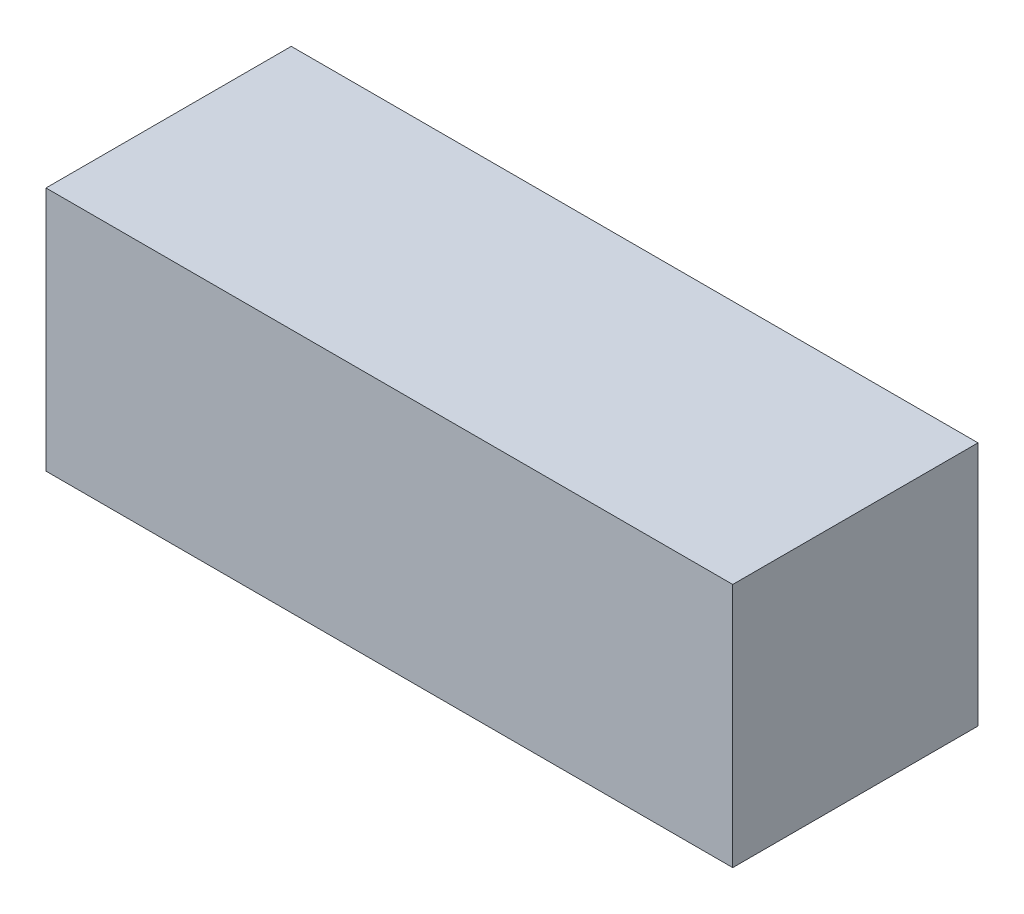
ISO-10303-21;
HEADER;
FILE_DESCRIPTION(('STEP AP214'),'2;1');
FILE_NAME('part.step','',(''),(''),'','','');
FILE_SCHEMA(('AUTOMOTIVE_DESIGN { 1 0 10303 214 1 1 1 1 }'));
ENDSEC;
DATA;
#1=APPLICATION_CONTEXT('core data for automotive mechanical design processes');
#2=APPLICATION_PROTOCOL_DEFINITION('international standard','automotive_design',2000,#1);
#3=PRODUCT_CONTEXT('',#1,'mechanical');
#4=PRODUCT('Part','Part','',(#3));
#5=PRODUCT_RELATED_PRODUCT_CATEGORY('part','',(#4));
#6=PRODUCT_DEFINITION_FORMATION('','',#4);
#7=PRODUCT_DEFINITION_CONTEXT('part definition',#1,'design');
#8=PRODUCT_DEFINITION('design','',#6,#7);
#9=PRODUCT_DEFINITION_SHAPE('','',#8);
#10=(LENGTH_UNIT() NAMED_UNIT(*) SI_UNIT(.MILLI.,.METRE.));
#11=(NAMED_UNIT(*) PLANE_ANGLE_UNIT() SI_UNIT($,.RADIAN.));
#12=(NAMED_UNIT(*) SI_UNIT($,.STERADIAN.) SOLID_ANGLE_UNIT());
#13=UNCERTAINTY_MEASURE_WITH_UNIT(LENGTH_MEASURE(1.E-05),#10,'distance_accuracy_value','');
#14=(GEOMETRIC_REPRESENTATION_CONTEXT(3) GLOBAL_UNCERTAINTY_ASSIGNED_CONTEXT((#13)) GLOBAL_UNIT_ASSIGNED_CONTEXT((#10,
#11,#12)) REPRESENTATION_CONTEXT('',''));
#15=CARTESIAN_POINT('',(0.,0.,0.));
#16=DIRECTION('',(0.,0.,1.));
#17=DIRECTION('',(1.,0.,0.));
#18=AXIS2_PLACEMENT_3D('',#15,#16,#17);
#19=CARTESIAN_POINT('',(1.41,-0.51,0.));
#20=DIRECTION('',(0.,0.,-1.));
#21=DIRECTION('',(-1.,0.,0.));
#22=AXIS2_PLACEMENT_3D('',#19,#20,#21);
#23=PLANE('',#22);
#24=DIRECTION('',(0.,-1.,0.));
#25=VECTOR('',#24,1.);
#26=CARTESIAN_POINT('',(-1.4,0.,0.));
#27=LINE('',#26,#25);
#28=CARTESIAN_POINT('',(-1.4,0.5,0.));
#29=VERTEX_POINT('',#28);
#30=CARTESIAN_POINT('',(-1.4,-0.5,0.));
#31=VERTEX_POINT('',#30);
#32=EDGE_CURVE('E68',#29,#31,#27,.T.);
#33=ORIENTED_EDGE('',*,*,#32,.F.);
#34=DIRECTION('',(-1.,0.,0.));
#35=VECTOR('',#34,1.);
#36=CARTESIAN_POINT('',(0.,0.5,0.));
#37=LINE('',#36,#35);
#38=CARTESIAN_POINT('',(1.4,0.5,0.));
#39=VERTEX_POINT('',#38);
#40=EDGE_CURVE('E55',#39,#29,#37,.T.);
#41=ORIENTED_EDGE('',*,*,#40,.F.);
#42=DIRECTION('',(0.,1.,0.));
#43=VECTOR('',#42,1.);
#44=CARTESIAN_POINT('',(1.4,0.,0.));
#45=LINE('',#44,#43);
#46=CARTESIAN_POINT('',(1.4,-0.5,0.));
#47=VERTEX_POINT('',#46);
#48=EDGE_CURVE('E20',#47,#39,#45,.T.);
#49=ORIENTED_EDGE('',*,*,#48,.F.);
#50=DIRECTION('',(1.,0.,0.));
#51=VECTOR('',#50,1.);
#52=CARTESIAN_POINT('',(0.,-0.5,0.));
#53=LINE('',#52,#51);
#54=EDGE_CURVE('E80',#31,#47,#53,.T.);
#55=ORIENTED_EDGE('',*,*,#54,.F.);
#56=EDGE_LOOP('',(#33,#41,#49,#55));
#57=FACE_BOUND('',#56,.T.);
#58=ADVANCED_FACE('F16',(#57),#23,.T.);
#59=CARTESIAN_POINT('',(1.4,-0.51,1.01));
#60=DIRECTION('',(1.,0.,0.));
#61=DIRECTION('',(0.,0.,-1.));
#62=AXIS2_PLACEMENT_3D('',#59,#60,#61);
#63=PLANE('',#62);
#64=DIRECTION('',(0.,0.,-1.));
#65=VECTOR('',#64,1.);
#66=CARTESIAN_POINT('',(1.4,0.5,0.5));
#67=LINE('',#66,#65);
#68=CARTESIAN_POINT('',(1.4,0.5,1.));
#69=VERTEX_POINT('',#68);
#70=EDGE_CURVE('E61',#69,#39,#67,.T.);
#71=ORIENTED_EDGE('',*,*,#70,.F.);
#72=DIRECTION('',(0.,1.,0.));
#73=VECTOR('',#72,1.);
#74=CARTESIAN_POINT('',(1.4,0.,1.));
#75=LINE('',#74,#73);
#76=CARTESIAN_POINT('',(1.4,-0.5,1.));
#77=VERTEX_POINT('',#76);
#78=EDGE_CURVE('E83',#77,#69,#75,.T.);
#79=ORIENTED_EDGE('',*,*,#78,.F.);
#80=DIRECTION('',(0.,0.,1.));
#81=VECTOR('',#80,1.);
#82=CARTESIAN_POINT('',(1.4,-0.5,0.5));
#83=LINE('',#82,#81);
#84=EDGE_CURVE('E64',#47,#77,#83,.T.);
#85=ORIENTED_EDGE('',*,*,#84,.F.);
#86=ORIENTED_EDGE('',*,*,#48,.T.);
#87=EDGE_LOOP('',(#71,#79,#85,#86));
#88=FACE_BOUND('',#87,.T.);
#89=ADVANCED_FACE('F60',(#88),#63,.T.);
#90=CARTESIAN_POINT('',(-1.41,0.5,-0.01));
#91=DIRECTION('',(0.,1.,0.));
#92=DIRECTION('',(0.,0.,1.));
#93=AXIS2_PLACEMENT_3D('',#90,#91,#92);
#94=PLANE('',#93);
#95=DIRECTION('',(0.,0.,-1.));
#96=VECTOR('',#95,1.);
#97=CARTESIAN_POINT('',(-1.4,0.5,0.5));
#98=LINE('',#97,#96);
#99=CARTESIAN_POINT('',(-1.4,0.5,1.));
#100=VERTEX_POINT('',#99);
#101=EDGE_CURVE('E70',#100,#29,#98,.T.);
#102=ORIENTED_EDGE('',*,*,#101,.F.);
#103=DIRECTION('',(-1.,0.,0.));
#104=VECTOR('',#103,1.);
#105=CARTESIAN_POINT('',(0.,0.5,1.));
#106=LINE('',#105,#104);
#107=EDGE_CURVE('E74',#69,#100,#106,.T.);
#108=ORIENTED_EDGE('',*,*,#107,.F.);
#109=ORIENTED_EDGE('',*,*,#70,.T.);
#110=ORIENTED_EDGE('',*,*,#40,.T.);
#111=EDGE_LOOP('',(#102,#108,#109,#110));
#112=FACE_BOUND('',#111,.T.);
#113=ADVANCED_FACE('F72',(#112),#94,.T.);
#114=CARTESIAN_POINT('',(-1.4,-0.51,-0.01));
#115=DIRECTION('',(-1.,0.,0.));
#116=DIRECTION('',(0.,0.,1.));
#117=AXIS2_PLACEMENT_3D('',#114,#115,#116);
#118=PLANE('',#117);
#119=DIRECTION('',(0.,0.,-1.));
#120=VECTOR('',#119,1.);
#121=CARTESIAN_POINT('',(-1.4,-0.5,0.5));
#122=LINE('',#121,#120);
#123=CARTESIAN_POINT('',(-1.4,-0.5,1.));
#124=VERTEX_POINT('',#123);
#125=EDGE_CURVE('E35',#124,#31,#122,.T.);
#126=ORIENTED_EDGE('',*,*,#125,.F.);
#127=DIRECTION('',(0.,-1.,0.));
#128=VECTOR('',#127,1.);
#129=CARTESIAN_POINT('',(-1.4,0.,1.));
#130=LINE('',#129,#128);
#131=EDGE_CURVE('E26',#100,#124,#130,.T.);
#132=ORIENTED_EDGE('',*,*,#131,.F.);
#133=ORIENTED_EDGE('',*,*,#101,.T.);
#134=ORIENTED_EDGE('',*,*,#32,.T.);
#135=EDGE_LOOP('',(#126,#132,#133,#134));
#136=FACE_BOUND('',#135,.T.);
#137=ADVANCED_FACE('F88',(#136),#118,.T.);
#138=CARTESIAN_POINT('',(-1.41,-0.5,1.01));
#139=DIRECTION('',(0.,-1.,0.));
#140=DIRECTION('',(0.,0.,-1.));
#141=AXIS2_PLACEMENT_3D('',#138,#139,#140);
#142=PLANE('',#141);
#143=ORIENTED_EDGE('',*,*,#84,.T.);
#144=DIRECTION('',(1.,0.,0.));
#145=VECTOR('',#144,1.);
#146=CARTESIAN_POINT('',(0.,-0.5,1.));
#147=LINE('',#146,#145);
#148=EDGE_CURVE('E11',#124,#77,#147,.T.);
#149=ORIENTED_EDGE('',*,*,#148,.F.);
#150=ORIENTED_EDGE('',*,*,#125,.T.);
#151=ORIENTED_EDGE('',*,*,#54,.T.);
#152=EDGE_LOOP('',(#143,#149,#150,#151));
#153=FACE_BOUND('',#152,.T.);
#154=ADVANCED_FACE('F90',(#153),#142,.T.);
#155=CARTESIAN_POINT('',(-1.41,-0.51,1.));
#156=DIRECTION('',(0.,0.,1.));
#157=DIRECTION('',(1.,0.,0.));
#158=AXIS2_PLACEMENT_3D('',#155,#156,#157);
#159=PLANE('',#158);
#160=ORIENTED_EDGE('',*,*,#131,.T.);
#161=ORIENTED_EDGE('',*,*,#148,.T.);
#162=ORIENTED_EDGE('',*,*,#78,.T.);
#163=ORIENTED_EDGE('',*,*,#107,.T.);
#164=EDGE_LOOP('',(#160,#161,#162,#163));
#165=FACE_BOUND('',#164,.T.);
#166=ADVANCED_FACE('F18',(#165),#159,.T.);
#167=CLOSED_SHELL('',(#58,#89,#113,#137,#154,#166));
#168=MANIFOLD_SOLID_BREP('B1',#167);
#169=ADVANCED_BREP_SHAPE_REPRESENTATION('',(#18,#168),#14);
#170=SHAPE_DEFINITION_REPRESENTATION(#9,#169);
ENDSEC;
END-ISO-10303-21;
